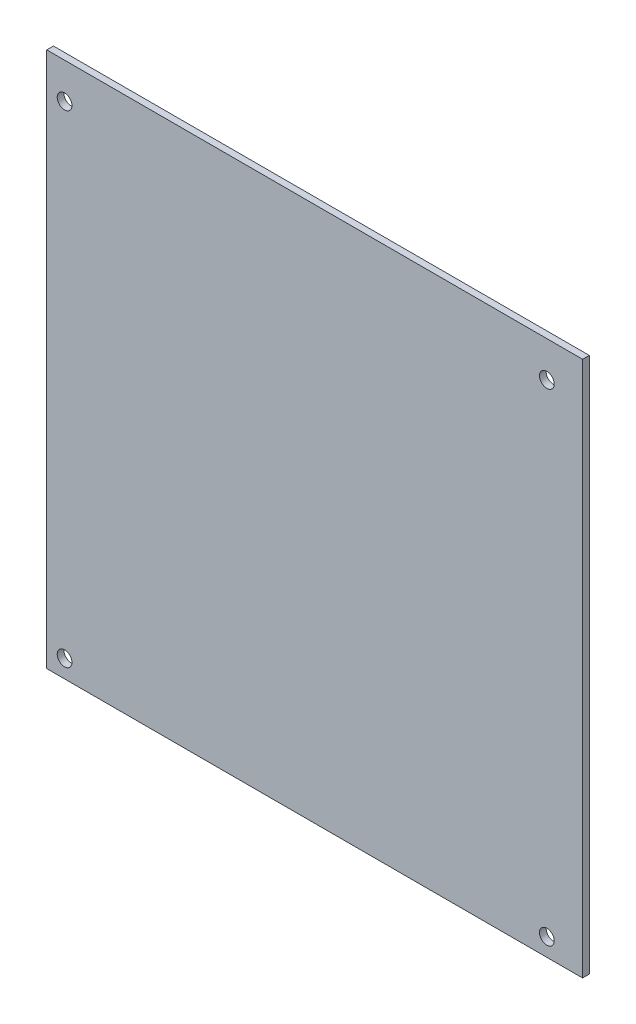
ISO-10303-21;
HEADER;
FILE_DESCRIPTION(('STEP AP214'),'2;1');
FILE_NAME('part.step','',(''),(''),'','','');
FILE_SCHEMA(('AUTOMOTIVE_DESIGN { 1 0 10303 214 1 1 1 1 }'));
ENDSEC;
DATA;
#1=APPLICATION_CONTEXT('core data for automotive mechanical design processes');
#2=APPLICATION_PROTOCOL_DEFINITION('international standard','automotive_design',2000,#1);
#3=PRODUCT_CONTEXT('',#1,'mechanical');
#4=PRODUCT('Part','Part','',(#3));
#5=PRODUCT_RELATED_PRODUCT_CATEGORY('part','',(#4));
#6=PRODUCT_DEFINITION_FORMATION('','',#4);
#7=PRODUCT_DEFINITION_CONTEXT('part definition',#1,'design');
#8=PRODUCT_DEFINITION('design','',#6,#7);
#9=PRODUCT_DEFINITION_SHAPE('','',#8);
#10=(LENGTH_UNIT() NAMED_UNIT(*) SI_UNIT(.MILLI.,.METRE.));
#11=(NAMED_UNIT(*) PLANE_ANGLE_UNIT() SI_UNIT($,.RADIAN.));
#12=(NAMED_UNIT(*) SI_UNIT($,.STERADIAN.) SOLID_ANGLE_UNIT());
#13=UNCERTAINTY_MEASURE_WITH_UNIT(LENGTH_MEASURE(1.E-05),#10,'distance_accuracy_value','');
#14=(GEOMETRIC_REPRESENTATION_CONTEXT(3) GLOBAL_UNCERTAINTY_ASSIGNED_CONTEXT((#13)) GLOBAL_UNIT_ASSIGNED_CONTEXT((#10,
#11,#12)) REPRESENTATION_CONTEXT('',''));
#15=CARTESIAN_POINT('',(0.,0.,0.));
#16=DIRECTION('',(0.,0.,1.));
#17=DIRECTION('',(1.,0.,0.));
#18=AXIS2_PLACEMENT_3D('',#15,#16,#17);
#19=CARTESIAN_POINT('',(0.,120.,1.5));
#20=DIRECTION('',(0.,0.,-1.));
#21=DIRECTION('',(-1.,0.,0.));
#22=AXIS2_PLACEMENT_3D('',#19,#20,#21);
#23=PLANE('',#22);
#24=CARTESIAN_POINT('',(4.,112.,1.5));
#25=DIRECTION('',(0.,0.,1.));
#26=DIRECTION('',(1.,0.,0.));
#27=AXIS2_PLACEMENT_3D('',#24,#25,#26);
#28=CIRCLE('',#27,1.65);
#29=CARTESIAN_POINT('',(5.65,112.,1.5));
#30=VERTEX_POINT('',#29);
#31=EDGE_CURVE('E118',#30,#30,#28,.T.);
#32=ORIENTED_EDGE('',*,*,#31,.F.);
#33=EDGE_LOOP('',(#32));
#34=FACE_BOUND('',#33,.T.);
#35=CARTESIAN_POINT('',(4.,4.,1.5));
#36=DIRECTION('',(0.,0.,1.));
#37=DIRECTION('',(1.,0.,0.));
#38=AXIS2_PLACEMENT_3D('',#35,#36,#37);
#39=CIRCLE('',#38,1.65);
#40=CARTESIAN_POINT('',(5.65,4.,1.5));
#41=VERTEX_POINT('',#40);
#42=EDGE_CURVE('E97',#41,#41,#39,.T.);
#43=ORIENTED_EDGE('',*,*,#42,.F.);
#44=EDGE_LOOP('',(#43));
#45=FACE_BOUND('',#44,.T.);
#46=DIRECTION('',(0.,-1.,0.));
#47=VECTOR('',#46,1.);
#48=CARTESIAN_POINT('',(0.,0.,1.5));
#49=LINE('',#48,#47);
#50=CARTESIAN_POINT('',(0.,120.,1.5));
#51=VERTEX_POINT('',#50);
#52=CARTESIAN_POINT('',(0.,0.,1.5));
#53=VERTEX_POINT('',#52);
#54=EDGE_CURVE('E82',#51,#53,#49,.T.);
#55=ORIENTED_EDGE('',*,*,#54,.T.);
#56=DIRECTION('',(1.,0.,0.));
#57=VECTOR('',#56,1.);
#58=CARTESIAN_POINT('',(0.,0.,1.5));
#59=LINE('',#58,#57);
#60=CARTESIAN_POINT('',(120.,0.,1.5));
#61=VERTEX_POINT('',#60);
#62=EDGE_CURVE('E77',#53,#61,#59,.T.);
#63=ORIENTED_EDGE('',*,*,#62,.T.);
#64=DIRECTION('',(0.,1.,0.));
#65=VECTOR('',#64,1.);
#66=CARTESIAN_POINT('',(120.,0.,1.5));
#67=LINE('',#66,#65);
#68=CARTESIAN_POINT('',(120.,120.,1.5));
#69=VERTEX_POINT('',#68);
#70=EDGE_CURVE('E80',#61,#69,#67,.T.);
#71=ORIENTED_EDGE('',*,*,#70,.T.);
#72=DIRECTION('',(-1.,0.,0.));
#73=VECTOR('',#72,1.);
#74=CARTESIAN_POINT('',(0.,120.,1.5));
#75=LINE('',#74,#73);
#76=EDGE_CURVE('E47',#69,#51,#75,.T.);
#77=ORIENTED_EDGE('',*,*,#76,.T.);
#78=EDGE_LOOP('',(#55,#63,#71,#77));
#79=FACE_BOUND('',#78,.T.);
#80=CARTESIAN_POINT('',(112.,4.,1.5));
#81=DIRECTION('',(0.,0.,1.));
#82=DIRECTION('',(1.,0.,0.));
#83=AXIS2_PLACEMENT_3D('',#80,#81,#82);
#84=CIRCLE('',#83,1.65);
#85=CARTESIAN_POINT('',(113.65,4.,1.5));
#86=VERTEX_POINT('',#85);
#87=EDGE_CURVE('E112',#86,#86,#84,.T.);
#88=ORIENTED_EDGE('',*,*,#87,.F.);
#89=EDGE_LOOP('',(#88));
#90=FACE_BOUND('',#89,.T.);
#91=CARTESIAN_POINT('',(112.,112.,1.5));
#92=DIRECTION('',(0.,0.,1.));
#93=DIRECTION('',(1.,0.,0.));
#94=AXIS2_PLACEMENT_3D('',#91,#92,#93);
#95=CIRCLE('',#94,1.65);
#96=CARTESIAN_POINT('',(113.65,112.,1.5));
#97=VERTEX_POINT('',#96);
#98=EDGE_CURVE('E124',#97,#97,#95,.T.);
#99=ORIENTED_EDGE('',*,*,#98,.F.);
#100=EDGE_LOOP('',(#99));
#101=FACE_BOUND('',#100,.T.);
#102=ADVANCED_FACE('F30',(#34,#45,#79,#90,#101),#23,.F.);
#103=CARTESIAN_POINT('',(0.,120.,0.));
#104=DIRECTION('',(0.,0.,-1.));
#105=DIRECTION('',(-1.,0.,0.));
#106=AXIS2_PLACEMENT_3D('',#103,#104,#105);
#107=PLANE('',#106);
#108=CARTESIAN_POINT('',(4.,112.,0.));
#109=DIRECTION('',(0.,0.,1.));
#110=DIRECTION('',(1.,0.,0.));
#111=AXIS2_PLACEMENT_3D('',#108,#109,#110);
#112=CIRCLE('',#111,1.65);
#113=CARTESIAN_POINT('',(5.65,112.,0.));
#114=VERTEX_POINT('',#113);
#115=EDGE_CURVE('E121',#114,#114,#112,.T.);
#116=ORIENTED_EDGE('',*,*,#115,.T.);
#117=EDGE_LOOP('',(#116));
#118=FACE_BOUND('',#117,.T.);
#119=CARTESIAN_POINT('',(4.,4.,0.));
#120=DIRECTION('',(0.,0.,1.));
#121=DIRECTION('',(1.,0.,0.));
#122=AXIS2_PLACEMENT_3D('',#119,#120,#121);
#123=CIRCLE('',#122,1.65);
#124=CARTESIAN_POINT('',(5.65,4.,0.));
#125=VERTEX_POINT('',#124);
#126=EDGE_CURVE('E109',#125,#125,#123,.T.);
#127=ORIENTED_EDGE('',*,*,#126,.T.);
#128=EDGE_LOOP('',(#127));
#129=FACE_BOUND('',#128,.T.);
#130=DIRECTION('',(0.,-1.,0.));
#131=VECTOR('',#130,1.);
#132=CARTESIAN_POINT('',(0.,0.,0.));
#133=LINE('',#132,#131);
#134=CARTESIAN_POINT('',(0.,120.,0.));
#135=VERTEX_POINT('',#134);
#136=CARTESIAN_POINT('',(0.,0.,0.));
#137=VERTEX_POINT('',#136);
#138=EDGE_CURVE('E94',#135,#137,#133,.T.);
#139=ORIENTED_EDGE('',*,*,#138,.F.);
#140=DIRECTION('',(-1.,0.,0.));
#141=VECTOR('',#140,1.);
#142=CARTESIAN_POINT('',(0.,120.,0.));
#143=LINE('',#142,#141);
#144=CARTESIAN_POINT('',(120.,120.,0.));
#145=VERTEX_POINT('',#144);
#146=EDGE_CURVE('E70',#145,#135,#143,.T.);
#147=ORIENTED_EDGE('',*,*,#146,.F.);
#148=DIRECTION('',(0.,1.,0.));
#149=VECTOR('',#148,1.);
#150=CARTESIAN_POINT('',(120.,0.,0.));
#151=LINE('',#150,#149);
#152=CARTESIAN_POINT('',(120.,0.,0.));
#153=VERTEX_POINT('',#152);
#154=EDGE_CURVE('E64',#153,#145,#151,.T.);
#155=ORIENTED_EDGE('',*,*,#154,.F.);
#156=DIRECTION('',(1.,0.,0.));
#157=VECTOR('',#156,1.);
#158=CARTESIAN_POINT('',(0.,0.,0.));
#159=LINE('',#158,#157);
#160=EDGE_CURVE('E86',#137,#153,#159,.T.);
#161=ORIENTED_EDGE('',*,*,#160,.F.);
#162=EDGE_LOOP('',(#139,#147,#155,#161));
#163=FACE_BOUND('',#162,.T.);
#164=CARTESIAN_POINT('',(112.,4.,0.));
#165=DIRECTION('',(0.,0.,1.));
#166=DIRECTION('',(1.,0.,0.));
#167=AXIS2_PLACEMENT_3D('',#164,#165,#166);
#168=CIRCLE('',#167,1.65);
#169=CARTESIAN_POINT('',(113.65,4.,0.));
#170=VERTEX_POINT('',#169);
#171=EDGE_CURVE('E115',#170,#170,#168,.T.);
#172=ORIENTED_EDGE('',*,*,#171,.T.);
#173=EDGE_LOOP('',(#172));
#174=FACE_BOUND('',#173,.T.);
#175=CARTESIAN_POINT('',(112.,112.,0.));
#176=DIRECTION('',(0.,0.,1.));
#177=DIRECTION('',(1.,0.,0.));
#178=AXIS2_PLACEMENT_3D('',#175,#176,#177);
#179=CIRCLE('',#178,1.65);
#180=CARTESIAN_POINT('',(113.65,112.,0.));
#181=VERTEX_POINT('',#180);
#182=EDGE_CURVE('E127',#181,#181,#179,.T.);
#183=ORIENTED_EDGE('',*,*,#182,.T.);
#184=EDGE_LOOP('',(#183));
#185=FACE_BOUND('',#184,.T.);
#186=ADVANCED_FACE('F105',(#118,#129,#163,#174,#185),#107,.T.);
#187=CARTESIAN_POINT('',(0.,0.,1.5));
#188=DIRECTION('',(1.,0.,0.));
#189=DIRECTION('',(0.,0.,-1.));
#190=AXIS2_PLACEMENT_3D('',#187,#188,#189);
#191=PLANE('',#190);
#192=ORIENTED_EDGE('',*,*,#138,.T.);
#193=DIRECTION('',(0.,0.,-1.));
#194=VECTOR('',#193,1.);
#195=CARTESIAN_POINT('',(0.,0.,1.5));
#196=LINE('',#195,#194);
#197=EDGE_CURVE('E11',#53,#137,#196,.T.);
#198=ORIENTED_EDGE('',*,*,#197,.F.);
#199=ORIENTED_EDGE('',*,*,#54,.F.);
#200=DIRECTION('',(0.,0.,-1.));
#201=VECTOR('',#200,1.);
#202=CARTESIAN_POINT('',(0.,120.,1.5));
#203=LINE('',#202,#201);
#204=EDGE_CURVE('E90',#51,#135,#203,.T.);
#205=ORIENTED_EDGE('',*,*,#204,.T.);
#206=EDGE_LOOP('',(#192,#198,#199,#205));
#207=FACE_BOUND('',#206,.T.);
#208=ADVANCED_FACE('F32',(#207),#191,.F.);
#209=CARTESIAN_POINT('',(0.,0.,1.5));
#210=DIRECTION('',(0.,1.,0.));
#211=DIRECTION('',(0.,0.,1.));
#212=AXIS2_PLACEMENT_3D('',#209,#210,#211);
#213=PLANE('',#212);
#214=ORIENTED_EDGE('',*,*,#160,.T.);
#215=DIRECTION('',(0.,0.,-1.));
#216=VECTOR('',#215,1.);
#217=CARTESIAN_POINT('',(120.,0.,1.5));
#218=LINE('',#217,#216);
#219=EDGE_CURVE('E39',#61,#153,#218,.T.);
#220=ORIENTED_EDGE('',*,*,#219,.F.);
#221=ORIENTED_EDGE('',*,*,#62,.F.);
#222=ORIENTED_EDGE('',*,*,#197,.T.);
#223=EDGE_LOOP('',(#214,#220,#221,#222));
#224=FACE_BOUND('',#223,.T.);
#225=ADVANCED_FACE('F85',(#224),#213,.F.);
#226=CARTESIAN_POINT('',(120.,0.,1.5));
#227=DIRECTION('',(-1.,0.,0.));
#228=DIRECTION('',(0.,0.,1.));
#229=AXIS2_PLACEMENT_3D('',#226,#227,#228);
#230=PLANE('',#229);
#231=ORIENTED_EDGE('',*,*,#154,.T.);
#232=DIRECTION('',(0.,0.,-1.));
#233=VECTOR('',#232,1.);
#234=CARTESIAN_POINT('',(120.,120.,1.5));
#235=LINE('',#234,#233);
#236=EDGE_CURVE('E87',#69,#145,#235,.T.);
#237=ORIENTED_EDGE('',*,*,#236,.F.);
#238=ORIENTED_EDGE('',*,*,#70,.F.);
#239=ORIENTED_EDGE('',*,*,#219,.T.);
#240=EDGE_LOOP('',(#231,#237,#238,#239));
#241=FACE_BOUND('',#240,.T.);
#242=ADVANCED_FACE('F88',(#241),#230,.F.);
#243=CARTESIAN_POINT('',(0.,120.,1.5));
#244=DIRECTION('',(0.,-1.,0.));
#245=DIRECTION('',(0.,0.,-1.));
#246=AXIS2_PLACEMENT_3D('',#243,#244,#245);
#247=PLANE('',#246);
#248=ORIENTED_EDGE('',*,*,#146,.T.);
#249=ORIENTED_EDGE('',*,*,#204,.F.);
#250=ORIENTED_EDGE('',*,*,#76,.F.);
#251=ORIENTED_EDGE('',*,*,#236,.T.);
#252=EDGE_LOOP('',(#248,#249,#250,#251));
#253=FACE_BOUND('',#252,.T.);
#254=ADVANCED_FACE('F102',(#253),#247,.F.);
#255=CARTESIAN_POINT('',(4.,4.,1.5));
#256=DIRECTION('',(0.,0.,-1.));
#257=DIRECTION('',(-1.,0.,0.));
#258=AXIS2_PLACEMENT_3D('',#255,#256,#257);
#259=CYLINDRICAL_SURFACE('',#258,1.65);
#260=ORIENTED_EDGE('',*,*,#42,.T.);
#261=EDGE_LOOP('',(#260));
#262=FACE_BOUND('',#261,.T.);
#263=ORIENTED_EDGE('',*,*,#126,.F.);
#264=EDGE_LOOP('',(#263));
#265=FACE_BOUND('',#264,.T.);
#266=ADVANCED_FACE('F147',(#262,#265),#259,.F.);
#267=CARTESIAN_POINT('',(112.,4.,1.5));
#268=DIRECTION('',(0.,0.,-1.));
#269=DIRECTION('',(-1.,0.,0.));
#270=AXIS2_PLACEMENT_3D('',#267,#268,#269);
#271=CYLINDRICAL_SURFACE('',#270,1.65);
#272=ORIENTED_EDGE('',*,*,#87,.T.);
#273=EDGE_LOOP('',(#272));
#274=FACE_BOUND('',#273,.T.);
#275=ORIENTED_EDGE('',*,*,#171,.F.);
#276=EDGE_LOOP('',(#275));
#277=FACE_BOUND('',#276,.T.);
#278=ADVANCED_FACE('F193',(#274,#277),#271,.F.);
#279=CARTESIAN_POINT('',(4.,112.,1.5));
#280=DIRECTION('',(0.,0.,-1.));
#281=DIRECTION('',(-1.,0.,0.));
#282=AXIS2_PLACEMENT_3D('',#279,#280,#281);
#283=CYLINDRICAL_SURFACE('',#282,1.65);
#284=ORIENTED_EDGE('',*,*,#31,.T.);
#285=EDGE_LOOP('',(#284));
#286=FACE_BOUND('',#285,.T.);
#287=ORIENTED_EDGE('',*,*,#115,.F.);
#288=EDGE_LOOP('',(#287));
#289=FACE_BOUND('',#288,.T.);
#290=ADVANCED_FACE('F201',(#286,#289),#283,.F.);
#291=CARTESIAN_POINT('',(112.,112.,1.5));
#292=DIRECTION('',(0.,0.,-1.));
#293=DIRECTION('',(-1.,0.,0.));
#294=AXIS2_PLACEMENT_3D('',#291,#292,#293);
#295=CYLINDRICAL_SURFACE('',#294,1.65);
#296=ORIENTED_EDGE('',*,*,#98,.T.);
#297=EDGE_LOOP('',(#296));
#298=FACE_BOUND('',#297,.T.);
#299=ORIENTED_EDGE('',*,*,#182,.F.);
#300=EDGE_LOOP('',(#299));
#301=FACE_BOUND('',#300,.T.);
#302=ADVANCED_FACE('F133',(#298,#301),#295,.F.);
#303=CLOSED_SHELL('',(#102,#186,#208,#225,#242,#254,#266,#278,#290,#302));
#304=MANIFOLD_SOLID_BREP('B2',#303);
#305=ADVANCED_BREP_SHAPE_REPRESENTATION('',(#18,#304),#14);
#306=SHAPE_DEFINITION_REPRESENTATION(#9,#305);
ENDSEC;
END-ISO-10303-21;
